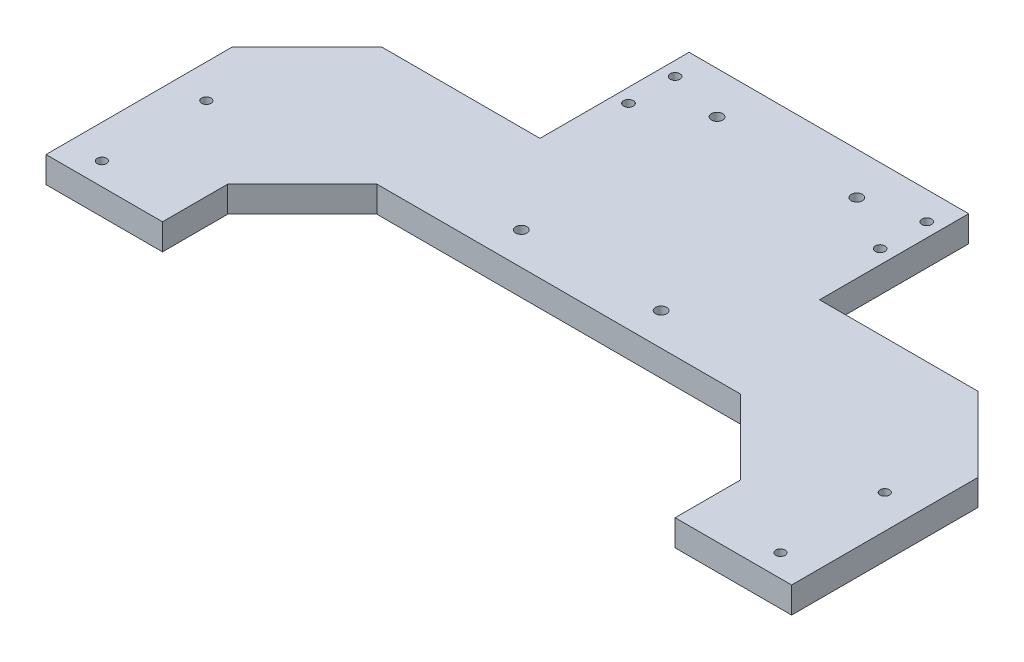
ISO-10303-21;
HEADER;
FILE_DESCRIPTION(('STEP AP214'),'2;1');
FILE_NAME('part.step','',(''),(''),'','','');
FILE_SCHEMA(('AUTOMOTIVE_DESIGN { 1 0 10303 214 1 1 1 1 }'));
ENDSEC;
DATA;
#1=APPLICATION_CONTEXT('core data for automotive mechanical design processes');
#2=APPLICATION_PROTOCOL_DEFINITION('international standard','automotive_design',2000,#1);
#3=PRODUCT_CONTEXT('',#1,'mechanical');
#4=PRODUCT('Part','Part','',(#3));
#5=PRODUCT_RELATED_PRODUCT_CATEGORY('part','',(#4));
#6=PRODUCT_DEFINITION_FORMATION('','',#4);
#7=PRODUCT_DEFINITION_CONTEXT('part definition',#1,'design');
#8=PRODUCT_DEFINITION('design','',#6,#7);
#9=PRODUCT_DEFINITION_SHAPE('','',#8);
#10=(LENGTH_UNIT() NAMED_UNIT(*) SI_UNIT(.MILLI.,.METRE.));
#11=(NAMED_UNIT(*) PLANE_ANGLE_UNIT() SI_UNIT($,.RADIAN.));
#12=(NAMED_UNIT(*) SI_UNIT($,.STERADIAN.) SOLID_ANGLE_UNIT());
#13=UNCERTAINTY_MEASURE_WITH_UNIT(LENGTH_MEASURE(1.E-05),#10,'distance_accuracy_value','');
#14=(GEOMETRIC_REPRESENTATION_CONTEXT(3) GLOBAL_UNCERTAINTY_ASSIGNED_CONTEXT((#13)) GLOBAL_UNIT_ASSIGNED_CONTEXT((#10,
#11,#12)) REPRESENTATION_CONTEXT('',''));
#15=CARTESIAN_POINT('',(0.,0.,0.));
#16=DIRECTION('',(0.,0.,1.));
#17=DIRECTION('',(1.,0.,0.));
#18=AXIS2_PLACEMENT_3D('',#15,#16,#17);
#19=CARTESIAN_POINT('',(-200.,14.,180.));
#20=DIRECTION('',(0.,0.,-1.));
#21=DIRECTION('',(-1.,0.,0.));
#22=AXIS2_PLACEMENT_3D('',#19,#20,#21);
#23=PLANE('',#22);
#24=DIRECTION('',(1.,0.,0.));
#25=VECTOR('',#24,1.);
#26=CARTESIAN_POINT('',(-200.,0.,180.));
#27=LINE('',#26,#25);
#28=CARTESIAN_POINT('',(-200.,0.,180.));
#29=VERTEX_POINT('',#28);
#30=CARTESIAN_POINT('',(-137.5,0.,180.));
#31=VERTEX_POINT('',#30);
#32=EDGE_CURVE('E166',#29,#31,#27,.T.);
#33=ORIENTED_EDGE('',*,*,#32,.T.);
#34=DIRECTION('',(0.,1.,0.));
#35=VECTOR('',#34,1.);
#36=CARTESIAN_POINT('',(-137.5,0.,180.));
#37=LINE('',#36,#35);
#38=CARTESIAN_POINT('',(-137.5,14.,180.));
#39=VERTEX_POINT('',#38);
#40=EDGE_CURVE('E177',#31,#39,#37,.T.);
#41=ORIENTED_EDGE('',*,*,#40,.T.);
#42=DIRECTION('',(1.,0.,0.));
#43=VECTOR('',#42,1.);
#44=CARTESIAN_POINT('',(-200.,14.,180.));
#45=LINE('',#44,#43);
#46=CARTESIAN_POINT('',(-200.,14.,180.));
#47=VERTEX_POINT('',#46);
#48=EDGE_CURVE('E333',#47,#39,#45,.T.);
#49=ORIENTED_EDGE('',*,*,#48,.F.);
#50=DIRECTION('',(0.,-1.,0.));
#51=VECTOR('',#50,1.);
#52=CARTESIAN_POINT('',(-200.,14.,180.));
#53=LINE('',#52,#51);
#54=EDGE_CURVE('E190',#47,#29,#53,.T.);
#55=ORIENTED_EDGE('',*,*,#54,.T.);
#56=EDGE_LOOP('',(#33,#41,#49,#55));
#57=FACE_BOUND('',#56,.T.);
#58=ADVANCED_FACE('F43',(#57),#23,.F.);
#59=CARTESIAN_POINT('',(75.,14.,40.));
#60=DIRECTION('',(-1.,0.,0.));
#61=DIRECTION('',(0.,0.,1.));
#62=AXIS2_PLACEMENT_3D('',#59,#60,#61);
#63=PLANE('',#62);
#64=DIRECTION('',(0.,0.,-1.));
#65=VECTOR('',#64,1.);
#66=CARTESIAN_POINT('',(75.,0.,40.));
#67=LINE('',#66,#65);
#68=CARTESIAN_POINT('',(75.,0.,40.));
#69=VERTEX_POINT('',#68);
#70=CARTESIAN_POINT('',(75.,0.,-40.));
#71=VERTEX_POINT('',#70);
#72=EDGE_CURVE('E347',#69,#71,#67,.T.);
#73=ORIENTED_EDGE('',*,*,#72,.T.);
#74=DIRECTION('',(0.,-1.,0.));
#75=VECTOR('',#74,1.);
#76=CARTESIAN_POINT('',(75.,14.,-40.));
#77=LINE('',#76,#75);
#78=CARTESIAN_POINT('',(75.,14.,-40.));
#79=VERTEX_POINT('',#78);
#80=EDGE_CURVE('E226',#79,#71,#77,.T.);
#81=ORIENTED_EDGE('',*,*,#80,.F.);
#82=DIRECTION('',(0.,0.,-1.));
#83=VECTOR('',#82,1.);
#84=CARTESIAN_POINT('',(75.,14.,40.));
#85=LINE('',#84,#83);
#86=CARTESIAN_POINT('',(75.,14.,40.));
#87=VERTEX_POINT('',#86);
#88=EDGE_CURVE('E206',#87,#79,#85,.T.);
#89=ORIENTED_EDGE('',*,*,#88,.F.);
#90=DIRECTION('',(0.,-1.,0.));
#91=VECTOR('',#90,1.);
#92=CARTESIAN_POINT('',(75.,14.,40.));
#93=LINE('',#92,#91);
#94=EDGE_CURVE('E207',#87,#69,#93,.T.);
#95=ORIENTED_EDGE('',*,*,#94,.T.);
#96=EDGE_LOOP('',(#73,#81,#89,#95));
#97=FACE_BOUND('',#96,.T.);
#98=ADVANCED_FACE('F302',(#97),#63,.F.);
#99=CARTESIAN_POINT('',(-75.,14.,-40.));
#100=DIRECTION('',(0.,0.,1.));
#101=DIRECTION('',(1.,0.,0.));
#102=AXIS2_PLACEMENT_3D('',#99,#100,#101);
#103=PLANE('',#102);
#104=DIRECTION('',(-1.,0.,0.));
#105=VECTOR('',#104,1.);
#106=CARTESIAN_POINT('',(-75.,0.,-40.));
#107=LINE('',#106,#105);
#108=CARTESIAN_POINT('',(-75.,0.,-40.));
#109=VERTEX_POINT('',#108);
#110=EDGE_CURVE('E351',#71,#109,#107,.T.);
#111=ORIENTED_EDGE('',*,*,#110,.T.);
#112=DIRECTION('',(0.,-1.,0.));
#113=VECTOR('',#112,1.);
#114=CARTESIAN_POINT('',(-75.,14.,-40.));
#115=LINE('',#114,#113);
#116=CARTESIAN_POINT('',(-75.,14.,-40.));
#117=VERTEX_POINT('',#116);
#118=EDGE_CURVE('E222',#117,#109,#115,.T.);
#119=ORIENTED_EDGE('',*,*,#118,.F.);
#120=DIRECTION('',(-1.,0.,0.));
#121=VECTOR('',#120,1.);
#122=CARTESIAN_POINT('',(-75.,14.,-40.));
#123=LINE('',#122,#121);
#124=EDGE_CURVE('E627',#79,#117,#123,.T.);
#125=ORIENTED_EDGE('',*,*,#124,.F.);
#126=ORIENTED_EDGE('',*,*,#80,.T.);
#127=EDGE_LOOP('',(#111,#119,#125,#126));
#128=FACE_BOUND('',#127,.T.);
#129=ADVANCED_FACE('F308',(#128),#103,.F.);
#130=CARTESIAN_POINT('',(-75.,14.,40.));
#131=DIRECTION('',(1.,0.,0.));
#132=DIRECTION('',(0.,0.,-1.));
#133=AXIS2_PLACEMENT_3D('',#130,#131,#132);
#134=PLANE('',#133);
#135=DIRECTION('',(0.,0.,1.));
#136=VECTOR('',#135,1.);
#137=CARTESIAN_POINT('',(-75.,0.,40.));
#138=LINE('',#137,#136);
#139=CARTESIAN_POINT('',(-75.,0.,40.));
#140=VERTEX_POINT('',#139);
#141=EDGE_CURVE('E355',#109,#140,#138,.T.);
#142=ORIENTED_EDGE('',*,*,#141,.T.);
#143=DIRECTION('',(0.,-1.,0.));
#144=VECTOR('',#143,1.);
#145=CARTESIAN_POINT('',(-75.,14.,40.));
#146=LINE('',#145,#144);
#147=CARTESIAN_POINT('',(-75.,14.,40.));
#148=VERTEX_POINT('',#147);
#149=EDGE_CURVE('E218',#148,#140,#146,.T.);
#150=ORIENTED_EDGE('',*,*,#149,.F.);
#151=DIRECTION('',(0.,0.,1.));
#152=VECTOR('',#151,1.);
#153=CARTESIAN_POINT('',(-75.,14.,40.));
#154=LINE('',#153,#152);
#155=EDGE_CURVE('E625',#117,#148,#154,.T.);
#156=ORIENTED_EDGE('',*,*,#155,.F.);
#157=ORIENTED_EDGE('',*,*,#118,.T.);
#158=EDGE_LOOP('',(#142,#150,#156,#157));
#159=FACE_BOUND('',#158,.T.);
#160=ADVANCED_FACE('F464',(#159),#134,.F.);
#161=CARTESIAN_POINT('',(-200.,14.,40.));
#162=DIRECTION('',(0.,0.,1.));
#163=DIRECTION('',(1.,0.,0.));
#164=AXIS2_PLACEMENT_3D('',#161,#162,#163);
#165=PLANE('',#164);
#166=DIRECTION('',(-1.,0.,0.));
#167=VECTOR('',#166,1.);
#168=CARTESIAN_POINT('',(-200.,0.,40.));
#169=LINE('',#168,#167);
#170=CARTESIAN_POINT('',(-160.,0.,40.));
#171=VERTEX_POINT('',#170);
#172=EDGE_CURVE('E357',#140,#171,#169,.T.);
#173=ORIENTED_EDGE('',*,*,#172,.T.);
#174=DIRECTION('',(0.,1.,0.));
#175=VECTOR('',#174,1.);
#176=CARTESIAN_POINT('',(-160.,14.,40.));
#177=LINE('',#176,#175);
#178=CARTESIAN_POINT('',(-160.,14.,40.));
#179=VERTEX_POINT('',#178);
#180=EDGE_CURVE('E68',#171,#179,#177,.T.);
#181=ORIENTED_EDGE('',*,*,#180,.T.);
#182=DIRECTION('',(-1.,0.,0.));
#183=VECTOR('',#182,1.);
#184=CARTESIAN_POINT('',(-200.,14.,40.));
#185=LINE('',#184,#183);
#186=EDGE_CURVE('E339',#148,#179,#185,.T.);
#187=ORIENTED_EDGE('',*,*,#186,.F.);
#188=ORIENTED_EDGE('',*,*,#149,.T.);
#189=EDGE_LOOP('',(#173,#181,#187,#188));
#190=FACE_BOUND('',#189,.T.);
#191=ADVANCED_FACE('F323',(#190),#165,.F.);
#192=CARTESIAN_POINT('',(-200.,14.,180.));
#193=DIRECTION('',(1.,0.,0.));
#194=DIRECTION('',(0.,0.,-1.));
#195=AXIS2_PLACEMENT_3D('',#192,#193,#194);
#196=PLANE('',#195);
#197=DIRECTION('',(0.,0.,1.));
#198=VECTOR('',#197,1.);
#199=CARTESIAN_POINT('',(-200.,14.,180.));
#200=LINE('',#199,#198);
#201=CARTESIAN_POINT('',(-200.,14.,80.));
#202=VERTEX_POINT('',#201);
#203=EDGE_CURVE('E334',#202,#47,#200,.T.);
#204=ORIENTED_EDGE('',*,*,#203,.F.);
#205=DIRECTION('',(0.,-1.,0.));
#206=VECTOR('',#205,1.);
#207=CARTESIAN_POINT('',(-200.,14.,80.));
#208=LINE('',#207,#206);
#209=CARTESIAN_POINT('',(-200.,0.,80.));
#210=VERTEX_POINT('',#209);
#211=EDGE_CURVE('E261',#202,#210,#208,.T.);
#212=ORIENTED_EDGE('',*,*,#211,.T.);
#213=DIRECTION('',(0.,0.,1.));
#214=VECTOR('',#213,1.);
#215=CARTESIAN_POINT('',(-200.,0.,180.));
#216=LINE('',#215,#214);
#217=EDGE_CURVE('E200',#210,#29,#216,.T.);
#218=ORIENTED_EDGE('',*,*,#217,.T.);
#219=ORIENTED_EDGE('',*,*,#54,.F.);
#220=EDGE_LOOP('',(#204,#212,#218,#219));
#221=FACE_BOUND('',#220,.T.);
#222=ADVANCED_FACE('F315',(#221),#196,.F.);
#223=CARTESIAN_POINT('',(137.5,14.,180.));
#224=VERTEX_POINT('',#223);
#225=CARTESIAN_POINT('',(200.,14.,180.));
#226=VERTEX_POINT('',#225);
#227=EDGE_CURVE('E328',#224,#226,#45,.T.);
#228=ORIENTED_EDGE('',*,*,#227,.F.);
#229=DIRECTION('',(0.,1.,0.));
#230=VECTOR('',#229,1.);
#231=CARTESIAN_POINT('',(137.5,0.,180.));
#232=LINE('',#231,#230);
#233=CARTESIAN_POINT('',(137.5,0.,180.));
#234=VERTEX_POINT('',#233);
#235=EDGE_CURVE('E185',#234,#224,#232,.T.);
#236=ORIENTED_EDGE('',*,*,#235,.F.);
#237=CARTESIAN_POINT('',(200.,0.,180.));
#238=VERTEX_POINT('',#237);
#239=EDGE_CURVE('E193',#234,#238,#27,.T.);
#240=ORIENTED_EDGE('',*,*,#239,.T.);
#241=DIRECTION('',(0.,-1.,0.));
#242=VECTOR('',#241,1.);
#243=CARTESIAN_POINT('',(200.,14.,180.));
#244=LINE('',#243,#242);
#245=EDGE_CURVE('E211',#226,#238,#244,.T.);
#246=ORIENTED_EDGE('',*,*,#245,.F.);
#247=EDGE_LOOP('',(#228,#236,#240,#246));
#248=FACE_BOUND('',#247,.T.);
#249=ADVANCED_FACE('F304',(#248),#23,.F.);
#250=CARTESIAN_POINT('',(200.,14.,180.));
#251=DIRECTION('',(-1.,0.,0.));
#252=DIRECTION('',(0.,0.,1.));
#253=AXIS2_PLACEMENT_3D('',#250,#251,#252);
#254=PLANE('',#253);
#255=DIRECTION('',(0.,0.,-1.));
#256=VECTOR('',#255,1.);
#257=CARTESIAN_POINT('',(200.,0.,180.));
#258=LINE('',#257,#256);
#259=CARTESIAN_POINT('',(200.,0.,80.0000000000001));
#260=VERTEX_POINT('',#259);
#261=EDGE_CURVE('E192',#238,#260,#258,.T.);
#262=ORIENTED_EDGE('',*,*,#261,.T.);
#263=DIRECTION('',(0.,1.,0.));
#264=VECTOR('',#263,1.);
#265=CARTESIAN_POINT('',(200.,14.,80.0000000000001));
#266=LINE('',#265,#264);
#267=CARTESIAN_POINT('',(200.,14.,80.0000000000001));
#268=VERTEX_POINT('',#267);
#269=EDGE_CURVE('E253',#260,#268,#266,.T.);
#270=ORIENTED_EDGE('',*,*,#269,.T.);
#271=DIRECTION('',(0.,0.,-1.));
#272=VECTOR('',#271,1.);
#273=CARTESIAN_POINT('',(200.,14.,180.));
#274=LINE('',#273,#272);
#275=EDGE_CURVE('E338',#226,#268,#274,.T.);
#276=ORIENTED_EDGE('',*,*,#275,.F.);
#277=ORIENTED_EDGE('',*,*,#245,.T.);
#278=EDGE_LOOP('',(#262,#270,#276,#277));
#279=FACE_BOUND('',#278,.T.);
#280=ADVANCED_FACE('F314',(#279),#254,.F.);
#281=CARTESIAN_POINT('',(75.,14.,40.));
#282=DIRECTION('',(0.,0.,1.));
#283=DIRECTION('',(1.,0.,0.));
#284=AXIS2_PLACEMENT_3D('',#281,#282,#283);
#285=PLANE('',#284);
#286=DIRECTION('',(-1.,0.,0.));
#287=VECTOR('',#286,1.);
#288=CARTESIAN_POINT('',(75.,14.,40.));
#289=LINE('',#288,#287);
#290=CARTESIAN_POINT('',(160.,14.,40.));
#291=VERTEX_POINT('',#290);
#292=EDGE_CURVE('E212',#291,#87,#289,.T.);
#293=ORIENTED_EDGE('',*,*,#292,.F.);
#294=DIRECTION('',(0.,-1.,0.));
#295=VECTOR('',#294,1.);
#296=CARTESIAN_POINT('',(160.,14.,40.));
#297=LINE('',#296,#295);
#298=CARTESIAN_POINT('',(160.,0.,40.));
#299=VERTEX_POINT('',#298);
#300=EDGE_CURVE('E243',#291,#299,#297,.T.);
#301=ORIENTED_EDGE('',*,*,#300,.T.);
#302=DIRECTION('',(-1.,0.,0.));
#303=VECTOR('',#302,1.);
#304=CARTESIAN_POINT('',(75.,0.,40.));
#305=LINE('',#304,#303);
#306=EDGE_CURVE('E198',#299,#69,#305,.T.);
#307=ORIENTED_EDGE('',*,*,#306,.T.);
#308=ORIENTED_EDGE('',*,*,#94,.F.);
#309=EDGE_LOOP('',(#293,#301,#307,#308));
#310=FACE_BOUND('',#309,.T.);
#311=ADVANCED_FACE('F321',(#310),#285,.F.);
#312=CARTESIAN_POINT('',(0.,14.,0.));
#313=DIRECTION('',(0.,-1.,0.));
#314=DIRECTION('',(0.,0.,-1.));
#315=AXIS2_PLACEMENT_3D('',#312,#313,#314);
#316=PLANE('',#315);
#317=CARTESIAN_POINT('',(-37.5,14.,87.5));
#318=DIRECTION('',(0.,-1.,0.));
#319=DIRECTION('',(0.,0.,-1.));
#320=AXIS2_PLACEMENT_3D('',#317,#318,#319);
#321=CIRCLE('',#320,3.);
#322=CARTESIAN_POINT('',(-37.5,14.,84.5));
#323=VERTEX_POINT('',#322);
#324=EDGE_CURVE('E352',#323,#323,#321,.T.);
#325=ORIENTED_EDGE('',*,*,#324,.T.);
#326=EDGE_LOOP('',(#325));
#327=FACE_BOUND('',#326,.T.);
#328=CARTESIAN_POINT('',(37.5,14.,87.4999999999999));
#329=DIRECTION('',(0.,-1.,0.));
#330=DIRECTION('',(0.,0.,-1.));
#331=AXIS2_PLACEMENT_3D('',#328,#329,#330);
#332=CIRCLE('',#331,3.);
#333=CARTESIAN_POINT('',(37.5,14.,84.4999999999999));
#334=VERTEX_POINT('',#333);
#335=EDGE_CURVE('E643',#334,#334,#332,.T.);
#336=ORIENTED_EDGE('',*,*,#335,.T.);
#337=EDGE_LOOP('',(#336));
#338=FACE_BOUND('',#337,.T.);
#339=CARTESIAN_POINT('',(37.5,14.,-17.5));
#340=DIRECTION('',(0.,-1.,0.));
#341=DIRECTION('',(0.,0.,-1.));
#342=AXIS2_PLACEMENT_3D('',#339,#340,#341);
#343=CIRCLE('',#342,3.);
#344=CARTESIAN_POINT('',(37.5,14.,-20.5));
#345=VERTEX_POINT('',#344);
#346=EDGE_CURVE('E647',#345,#345,#343,.T.);
#347=ORIENTED_EDGE('',*,*,#346,.T.);
#348=EDGE_LOOP('',(#347));
#349=FACE_BOUND('',#348,.T.);
#350=CARTESIAN_POINT('',(-67.5,14.,0.));
#351=DIRECTION('',(0.,-1.,0.));
#352=DIRECTION('',(0.,0.,-1.));
#353=AXIS2_PLACEMENT_3D('',#350,#351,#352);
#354=CIRCLE('',#353,2.6);
#355=CARTESIAN_POINT('',(-67.5,14.,-2.60000000000001));
#356=VERTEX_POINT('',#355);
#357=EDGE_CURVE('E651',#356,#356,#354,.T.);
#358=ORIENTED_EDGE('',*,*,#357,.T.);
#359=EDGE_LOOP('',(#358));
#360=FACE_BOUND('',#359,.T.);
#361=CARTESIAN_POINT('',(-182.,14.,168.));
#362=DIRECTION('',(0.,-1.,0.));
#363=DIRECTION('',(0.,0.,-1.));
#364=AXIS2_PLACEMENT_3D('',#361,#362,#363);
#365=CIRCLE('',#364,2.5);
#366=CARTESIAN_POINT('',(-182.,14.,165.5));
#367=VERTEX_POINT('',#366);
#368=EDGE_CURVE('E655',#367,#367,#365,.T.);
#369=ORIENTED_EDGE('',*,*,#368,.T.);
#370=EDGE_LOOP('',(#369));
#371=FACE_BOUND('',#370,.T.);
#372=CARTESIAN_POINT('',(-182.,14.,112.));
#373=DIRECTION('',(0.,-1.,0.));
#374=DIRECTION('',(0.,0.,-1.));
#375=AXIS2_PLACEMENT_3D('',#372,#373,#374);
#376=CIRCLE('',#375,2.5);
#377=CARTESIAN_POINT('',(-182.,14.,109.5));
#378=VERTEX_POINT('',#377);
#379=EDGE_CURVE('E659',#378,#378,#376,.T.);
#380=ORIENTED_EDGE('',*,*,#379,.T.);
#381=EDGE_LOOP('',(#380));
#382=FACE_BOUND('',#381,.T.);
#383=CARTESIAN_POINT('',(-37.5,14.,-17.5));
#384=DIRECTION('',(0.,-1.,0.));
#385=DIRECTION('',(0.,0.,-1.));
#386=AXIS2_PLACEMENT_3D('',#383,#384,#385);
#387=CIRCLE('',#386,3.);
#388=CARTESIAN_POINT('',(-37.5,14.,-20.5));
#389=VERTEX_POINT('',#388);
#390=EDGE_CURVE('E663',#389,#389,#387,.T.);
#391=ORIENTED_EDGE('',*,*,#390,.T.);
#392=EDGE_LOOP('',(#391));
#393=FACE_BOUND('',#392,.T.);
#394=CARTESIAN_POINT('',(182.,14.,112.));
#395=DIRECTION('',(0.,-1.,0.));
#396=DIRECTION('',(0.,0.,-1.));
#397=AXIS2_PLACEMENT_3D('',#394,#395,#396);
#398=CIRCLE('',#397,2.50000000000005);
#399=CARTESIAN_POINT('',(182.,14.,109.5));
#400=VERTEX_POINT('',#399);
#401=EDGE_CURVE('E667',#400,#400,#398,.T.);
#402=ORIENTED_EDGE('',*,*,#401,.T.);
#403=EDGE_LOOP('',(#402));
#404=FACE_BOUND('',#403,.T.);
#405=CARTESIAN_POINT('',(182.,14.,168.));
#406=DIRECTION('',(0.,-1.,0.));
#407=DIRECTION('',(0.,0.,-1.));
#408=AXIS2_PLACEMENT_3D('',#405,#406,#407);
#409=CIRCLE('',#408,2.50000000000006);
#410=CARTESIAN_POINT('',(182.,14.,165.5));
#411=VERTEX_POINT('',#410);
#412=EDGE_CURVE('E671',#411,#411,#409,.T.);
#413=ORIENTED_EDGE('',*,*,#412,.T.);
#414=EDGE_LOOP('',(#413));
#415=FACE_BOUND('',#414,.T.);
#416=CARTESIAN_POINT('',(67.5,14.,0.));
#417=DIRECTION('',(0.,-1.,0.));
#418=DIRECTION('',(0.,0.,-1.));
#419=AXIS2_PLACEMENT_3D('',#416,#417,#418);
#420=CIRCLE('',#419,2.6);
#421=CARTESIAN_POINT('',(67.5,14.,-2.60000000000005));
#422=VERTEX_POINT('',#421);
#423=EDGE_CURVE('E675',#422,#422,#420,.T.);
#424=ORIENTED_EDGE('',*,*,#423,.T.);
#425=EDGE_LOOP('',(#424));
#426=FACE_BOUND('',#425,.T.);
#427=CARTESIAN_POINT('',(67.5,14.,-25.));
#428=DIRECTION('',(0.,-1.,0.));
#429=DIRECTION('',(0.,0.,-1.));
#430=AXIS2_PLACEMENT_3D('',#427,#428,#429);
#431=CIRCLE('',#430,2.6);
#432=CARTESIAN_POINT('',(67.5,14.,-27.6));
#433=VERTEX_POINT('',#432);
#434=EDGE_CURVE('E679',#433,#433,#431,.T.);
#435=ORIENTED_EDGE('',*,*,#434,.T.);
#436=EDGE_LOOP('',(#435));
#437=FACE_BOUND('',#436,.T.);
#438=CARTESIAN_POINT('',(-67.5,14.,-25.));
#439=DIRECTION('',(0.,-1.,0.));
#440=DIRECTION('',(0.,0.,-1.));
#441=AXIS2_PLACEMENT_3D('',#438,#439,#440);
#442=CIRCLE('',#441,2.6);
#443=CARTESIAN_POINT('',(-67.5,14.,-27.6));
#444=VERTEX_POINT('',#443);
#445=EDGE_CURVE('E683',#444,#444,#442,.T.);
#446=ORIENTED_EDGE('',*,*,#445,.T.);
#447=EDGE_LOOP('',(#446));
#448=FACE_BOUND('',#447,.T.);
#449=ORIENTED_EDGE('',*,*,#275,.T.);
#450=DIRECTION('',(0.707106781186547,0.,0.707106781186548));
#451=VECTOR('',#450,1.);
#452=CARTESIAN_POINT('',(160.,14.,40.));
#453=LINE('',#452,#451);
#454=EDGE_CURVE('E258',#268,#291,#453,.F.);
#455=ORIENTED_EDGE('',*,*,#454,.T.);
#456=ORIENTED_EDGE('',*,*,#292,.T.);
#457=ORIENTED_EDGE('',*,*,#88,.T.);
#458=ORIENTED_EDGE('',*,*,#124,.T.);
#459=ORIENTED_EDGE('',*,*,#155,.T.);
#460=ORIENTED_EDGE('',*,*,#186,.T.);
#461=DIRECTION('',(0.707106781186549,0.,-0.707106781186547));
#462=VECTOR('',#461,1.);
#463=CARTESIAN_POINT('',(-200.,14.,80.));
#464=LINE('',#463,#462);
#465=EDGE_CURVE('E60',#179,#202,#464,.F.);
#466=ORIENTED_EDGE('',*,*,#465,.T.);
#467=ORIENTED_EDGE('',*,*,#203,.T.);
#468=ORIENTED_EDGE('',*,*,#48,.T.);
#469=DIRECTION('',(0.,0.,-1.));
#470=VECTOR('',#469,1.);
#471=CARTESIAN_POINT('',(-137.5,14.,0.));
#472=LINE('',#471,#470);
#473=CARTESIAN_POINT('',(-137.5,14.,145.));
#474=VERTEX_POINT('',#473);
#475=EDGE_CURVE('E180',#39,#474,#472,.T.);
#476=ORIENTED_EDGE('',*,*,#475,.T.);
#477=DIRECTION('',(-0.707106781186544,0.,0.707106781186551));
#478=VECTOR('',#477,1.);
#479=CARTESIAN_POINT('',(3.74999999999955,14.,3.74999999999952));
#480=LINE('',#479,#478);
#481=CARTESIAN_POINT('',(-97.5,14.,105.));
#482=VERTEX_POINT('',#481);
#483=EDGE_CURVE('E53',#474,#482,#480,.F.);
#484=ORIENTED_EDGE('',*,*,#483,.T.);
#485=DIRECTION('',(1.,0.,0.));
#486=VECTOR('',#485,1.);
#487=CARTESIAN_POINT('',(0.,14.,105.));
#488=LINE('',#487,#486);
#489=CARTESIAN_POINT('',(97.4999999999997,14.,105.));
#490=VERTEX_POINT('',#489);
#491=EDGE_CURVE('E277',#482,#490,#488,.T.);
#492=ORIENTED_EDGE('',*,*,#491,.T.);
#493=DIRECTION('',(-0.707106781186551,0.,-0.707106781186544));
#494=VECTOR('',#493,1.);
#495=CARTESIAN_POINT('',(-3.75000000000068,14.,3.75000000000072));
#496=LINE('',#495,#494);
#497=CARTESIAN_POINT('',(137.5,14.,145.));
#498=VERTEX_POINT('',#497);
#499=EDGE_CURVE('E267',#490,#498,#496,.F.);
#500=ORIENTED_EDGE('',*,*,#499,.T.);
#501=DIRECTION('',(0.,0.,1.));
#502=VECTOR('',#501,1.);
#503=CARTESIAN_POINT('',(137.5,14.,0.));
#504=LINE('',#503,#502);
#505=EDGE_CURVE('E285',#498,#224,#504,.T.);
#506=ORIENTED_EDGE('',*,*,#505,.T.);
#507=ORIENTED_EDGE('',*,*,#227,.T.);
#508=EDGE_LOOP('',(#449,#455,#456,#457,#458,#459,#460,#466,#467,#468,#476,#484,#492,#500,#506,#507));
#509=FACE_BOUND('',#508,.T.);
#510=ADVANCED_FACE('F276',(#327,#338,#349,#360,#371,#382,#393,#404,#415,#426,#437,#448,#509),
#316,.F.);
#511=CARTESIAN_POINT('',(0.,0.,0.));
#512=DIRECTION('',(0.,-1.,0.));
#513=DIRECTION('',(0.,0.,-1.));
#514=AXIS2_PLACEMENT_3D('',#511,#512,#513);
#515=PLANE('',#514);
#516=CARTESIAN_POINT('',(-37.5,0.,87.5));
#517=DIRECTION('',(0.,1.,0.));
#518=DIRECTION('',(0.,0.,1.));
#519=AXIS2_PLACEMENT_3D('',#516,#517,#518);
#520=CIRCLE('',#519,3.);
#521=CARTESIAN_POINT('',(-37.5,0.,90.5));
#522=VERTEX_POINT('',#521);
#523=EDGE_CURVE('E704',#522,#522,#520,.T.);
#524=ORIENTED_EDGE('',*,*,#523,.T.);
#525=EDGE_LOOP('',(#524));
#526=FACE_BOUND('',#525,.T.);
#527=ORIENTED_EDGE('',*,*,#306,.F.);
#528=DIRECTION('',(-0.707106781186547,0.,-0.707106781186548));
#529=VECTOR('',#528,1.);
#530=CARTESIAN_POINT('',(60.0000000000002,0.,-60.));
#531=LINE('',#530,#529);
#532=EDGE_CURVE('E250',#299,#260,#531,.F.);
#533=ORIENTED_EDGE('',*,*,#532,.T.);
#534=ORIENTED_EDGE('',*,*,#261,.F.);
#535=ORIENTED_EDGE('',*,*,#239,.F.);
#536=DIRECTION('',(0.,0.,-1.));
#537=VECTOR('',#536,1.);
#538=CARTESIAN_POINT('',(137.5,0.,105.));
#539=LINE('',#538,#537);
#540=CARTESIAN_POINT('',(137.5,0.,145.));
#541=VERTEX_POINT('',#540);
#542=EDGE_CURVE('E173',#234,#541,#539,.T.);
#543=ORIENTED_EDGE('',*,*,#542,.T.);
#544=DIRECTION('',(0.707106781186551,0.,0.707106781186544));
#545=VECTOR('',#544,1.);
#546=CARTESIAN_POINT('',(97.4999999999997,0.,105.));
#547=LINE('',#546,#545);
#548=CARTESIAN_POINT('',(97.4999999999997,0.,105.));
#549=VERTEX_POINT('',#548);
#550=EDGE_CURVE('E270',#541,#549,#547,.F.);
#551=ORIENTED_EDGE('',*,*,#550,.T.);
#552=DIRECTION('',(-1.,0.,0.));
#553=VECTOR('',#552,1.);
#554=CARTESIAN_POINT('',(137.5,0.,105.));
#555=LINE('',#554,#553);
#556=CARTESIAN_POINT('',(-97.5,0.,105.));
#557=VERTEX_POINT('',#556);
#558=EDGE_CURVE('E186',#549,#557,#555,.T.);
#559=ORIENTED_EDGE('',*,*,#558,.T.);
#560=DIRECTION('',(0.707106781186544,0.,-0.707106781186551));
#561=VECTOR('',#560,1.);
#562=CARTESIAN_POINT('',(-137.5,0.,145.));
#563=LINE('',#562,#561);
#564=CARTESIAN_POINT('',(-137.5,0.,145.));
#565=VERTEX_POINT('',#564);
#566=EDGE_CURVE('E11',#557,#565,#563,.F.);
#567=ORIENTED_EDGE('',*,*,#566,.T.);
#568=DIRECTION('',(0.,0.,1.));
#569=VECTOR('',#568,1.);
#570=CARTESIAN_POINT('',(-137.5,0.,105.));
#571=LINE('',#570,#569);
#572=EDGE_CURVE('E159',#565,#31,#571,.T.);
#573=ORIENTED_EDGE('',*,*,#572,.T.);
#574=ORIENTED_EDGE('',*,*,#32,.F.);
#575=ORIENTED_EDGE('',*,*,#217,.F.);
#576=DIRECTION('',(-0.707106781186549,0.,0.707106781186547));
#577=VECTOR('',#576,1.);
#578=CARTESIAN_POINT('',(-59.9999999999997,0.,-59.9999999999999));
#579=LINE('',#578,#577);
#580=EDGE_CURVE('E247',#210,#171,#579,.F.);
#581=ORIENTED_EDGE('',*,*,#580,.T.);
#582=ORIENTED_EDGE('',*,*,#172,.F.);
#583=ORIENTED_EDGE('',*,*,#141,.F.);
#584=ORIENTED_EDGE('',*,*,#110,.F.);
#585=ORIENTED_EDGE('',*,*,#72,.F.);
#586=EDGE_LOOP('',(#527,#533,#534,#535,#543,#551,#559,#567,#573,#574,#575,#581,#582,#583,#584,#585));
#587=FACE_BOUND('',#586,.T.);
#588=CARTESIAN_POINT('',(37.5,0.,87.4999999999999));
#589=DIRECTION('',(0.,1.,0.));
#590=DIRECTION('',(0.,0.,-1.));
#591=AXIS2_PLACEMENT_3D('',#588,#589,#590);
#592=CIRCLE('',#591,3.);
#593=CARTESIAN_POINT('',(37.5,0.,84.4999999999999));
#594=VERTEX_POINT('',#593);
#595=EDGE_CURVE('E174',#594,#594,#592,.T.);
#596=ORIENTED_EDGE('',*,*,#595,.T.);
#597=EDGE_LOOP('',(#596));
#598=FACE_BOUND('',#597,.T.);
#599=CARTESIAN_POINT('',(37.5,0.,-17.5));
#600=DIRECTION('',(0.,1.,0.));
#601=DIRECTION('',(0.,0.,-1.));
#602=AXIS2_PLACEMENT_3D('',#599,#600,#601);
#603=CIRCLE('',#602,3.);
#604=CARTESIAN_POINT('',(37.5,0.,-20.5));
#605=VERTEX_POINT('',#604);
#606=EDGE_CURVE('E718',#605,#605,#603,.T.);
#607=ORIENTED_EDGE('',*,*,#606,.T.);
#608=EDGE_LOOP('',(#607));
#609=FACE_BOUND('',#608,.T.);
#610=CARTESIAN_POINT('',(-67.5,0.,0.));
#611=DIRECTION('',(0.,1.,0.));
#612=DIRECTION('',(0.,0.,1.));
#613=AXIS2_PLACEMENT_3D('',#610,#611,#612);
#614=CIRCLE('',#613,2.6);
#615=CARTESIAN_POINT('',(-67.5,0.,2.6));
#616=VERTEX_POINT('',#615);
#617=EDGE_CURVE('E691',#616,#616,#614,.T.);
#618=ORIENTED_EDGE('',*,*,#617,.T.);
#619=EDGE_LOOP('',(#618));
#620=FACE_BOUND('',#619,.T.);
#621=CARTESIAN_POINT('',(-182.,0.,168.));
#622=DIRECTION('',(0.,1.,0.));
#623=DIRECTION('',(0.,0.,1.));
#624=AXIS2_PLACEMENT_3D('',#621,#622,#623);
#625=CIRCLE('',#624,2.5);
#626=CARTESIAN_POINT('',(-182.,0.,170.5));
#627=VERTEX_POINT('',#626);
#628=EDGE_CURVE('E692',#627,#627,#625,.T.);
#629=ORIENTED_EDGE('',*,*,#628,.T.);
#630=EDGE_LOOP('',(#629));
#631=FACE_BOUND('',#630,.T.);
#632=CARTESIAN_POINT('',(-182.,0.,112.));
#633=DIRECTION('',(0.,1.,0.));
#634=DIRECTION('',(0.,0.,1.));
#635=AXIS2_PLACEMENT_3D('',#632,#633,#634);
#636=CIRCLE('',#635,2.5);
#637=CARTESIAN_POINT('',(-182.,0.,114.5));
#638=VERTEX_POINT('',#637);
#639=EDGE_CURVE('E696',#638,#638,#636,.T.);
#640=ORIENTED_EDGE('',*,*,#639,.T.);
#641=EDGE_LOOP('',(#640));
#642=FACE_BOUND('',#641,.T.);
#643=CARTESIAN_POINT('',(-37.5,0.,-17.5));
#644=DIRECTION('',(0.,1.,0.));
#645=DIRECTION('',(0.,0.,1.));
#646=AXIS2_PLACEMENT_3D('',#643,#644,#645);
#647=CIRCLE('',#646,3.);
#648=CARTESIAN_POINT('',(-37.5,0.,-14.5));
#649=VERTEX_POINT('',#648);
#650=EDGE_CURVE('E700',#649,#649,#647,.T.);
#651=ORIENTED_EDGE('',*,*,#650,.T.);
#652=EDGE_LOOP('',(#651));
#653=FACE_BOUND('',#652,.T.);
#654=CARTESIAN_POINT('',(182.,0.,112.));
#655=DIRECTION('',(0.,1.,0.));
#656=DIRECTION('',(0.,0.,-1.));
#657=AXIS2_PLACEMENT_3D('',#654,#655,#656);
#658=CIRCLE('',#657,2.50000000000005);
#659=CARTESIAN_POINT('',(182.,0.,109.5));
#660=VERTEX_POINT('',#659);
#661=EDGE_CURVE('E722',#660,#660,#658,.T.);
#662=ORIENTED_EDGE('',*,*,#661,.T.);
#663=EDGE_LOOP('',(#662));
#664=FACE_BOUND('',#663,.T.);
#665=CARTESIAN_POINT('',(182.,0.,168.));
#666=DIRECTION('',(0.,1.,0.));
#667=DIRECTION('',(0.,0.,-1.));
#668=AXIS2_PLACEMENT_3D('',#665,#666,#667);
#669=CIRCLE('',#668,2.50000000000006);
#670=CARTESIAN_POINT('',(182.,0.,165.5));
#671=VERTEX_POINT('',#670);
#672=EDGE_CURVE('E734',#671,#671,#669,.T.);
#673=ORIENTED_EDGE('',*,*,#672,.T.);
#674=EDGE_LOOP('',(#673));
#675=FACE_BOUND('',#674,.T.);
#676=CARTESIAN_POINT('',(67.5,0.,0.));
#677=DIRECTION('',(0.,1.,0.));
#678=DIRECTION('',(0.,0.,-1.));
#679=AXIS2_PLACEMENT_3D('',#676,#677,#678);
#680=CIRCLE('',#679,2.6);
#681=CARTESIAN_POINT('',(67.5,0.,-2.60000000000005));
#682=VERTEX_POINT('',#681);
#683=EDGE_CURVE('E730',#682,#682,#680,.T.);
#684=ORIENTED_EDGE('',*,*,#683,.T.);
#685=EDGE_LOOP('',(#684));
#686=FACE_BOUND('',#685,.T.);
#687=CARTESIAN_POINT('',(67.5,0.,-25.));
#688=DIRECTION('',(0.,1.,0.));
#689=DIRECTION('',(0.,0.,-1.));
#690=AXIS2_PLACEMENT_3D('',#687,#688,#689);
#691=CIRCLE('',#690,2.6);
#692=CARTESIAN_POINT('',(67.5,0.,-27.6));
#693=VERTEX_POINT('',#692);
#694=EDGE_CURVE('E726',#693,#693,#691,.T.);
#695=ORIENTED_EDGE('',*,*,#694,.T.);
#696=EDGE_LOOP('',(#695));
#697=FACE_BOUND('',#696,.T.);
#698=CARTESIAN_POINT('',(-67.5,0.,-25.));
#699=DIRECTION('',(0.,1.,0.));
#700=DIRECTION('',(0.,0.,1.));
#701=AXIS2_PLACEMENT_3D('',#698,#699,#700);
#702=CIRCLE('',#701,2.6);
#703=CARTESIAN_POINT('',(-67.5,0.,-22.4));
#704=VERTEX_POINT('',#703);
#705=EDGE_CURVE('E687',#704,#704,#702,.T.);
#706=ORIENTED_EDGE('',*,*,#705,.T.);
#707=EDGE_LOOP('',(#706));
#708=FACE_BOUND('',#707,.T.);
#709=ADVANCED_FACE('F162',(#526,#587,#598,#609,#620,#631,#642,#653,#664,#675,#686,#697,#708),
#515,.T.);
#710=CARTESIAN_POINT('',(-67.5,0.,-25.));
#711=DIRECTION('',(0.,1.,0.));
#712=DIRECTION('',(0.,0.,1.));
#713=AXIS2_PLACEMENT_3D('',#710,#711,#712);
#714=CYLINDRICAL_SURFACE('',#713,2.6);
#715=ORIENTED_EDGE('',*,*,#705,.F.);
#716=EDGE_LOOP('',(#715));
#717=FACE_BOUND('',#716,.T.);
#718=ORIENTED_EDGE('',*,*,#445,.F.);
#719=EDGE_LOOP('',(#718));
#720=FACE_BOUND('',#719,.T.);
#721=ADVANCED_FACE('F421',(#717,#720),#714,.F.);
#722=CARTESIAN_POINT('',(67.5,0.,-25.));
#723=DIRECTION('',(0.,1.,0.));
#724=DIRECTION('',(0.,0.,1.));
#725=AXIS2_PLACEMENT_3D('',#722,#723,#724);
#726=CYLINDRICAL_SURFACE('',#725,2.6);
#727=ORIENTED_EDGE('',*,*,#694,.F.);
#728=EDGE_LOOP('',(#727));
#729=FACE_BOUND('',#728,.T.);
#730=ORIENTED_EDGE('',*,*,#434,.F.);
#731=EDGE_LOOP('',(#730));
#732=FACE_BOUND('',#731,.T.);
#733=ADVANCED_FACE('F560',(#729,#732),#726,.F.);
#734=CARTESIAN_POINT('',(67.5,0.,0.));
#735=DIRECTION('',(0.,1.,0.));
#736=DIRECTION('',(0.,0.,1.));
#737=AXIS2_PLACEMENT_3D('',#734,#735,#736);
#738=CYLINDRICAL_SURFACE('',#737,2.6);
#739=ORIENTED_EDGE('',*,*,#683,.F.);
#740=EDGE_LOOP('',(#739));
#741=FACE_BOUND('',#740,.T.);
#742=ORIENTED_EDGE('',*,*,#423,.F.);
#743=EDGE_LOOP('',(#742));
#744=FACE_BOUND('',#743,.T.);
#745=ADVANCED_FACE('F550',(#741,#744),#738,.F.);
#746=CARTESIAN_POINT('',(182.,0.,168.));
#747=DIRECTION('',(0.,1.,0.));
#748=DIRECTION('',(0.,0.,1.));
#749=AXIS2_PLACEMENT_3D('',#746,#747,#748);
#750=CYLINDRICAL_SURFACE('',#749,2.50000000000006);
#751=ORIENTED_EDGE('',*,*,#672,.F.);
#752=EDGE_LOOP('',(#751));
#753=FACE_BOUND('',#752,.T.);
#754=ORIENTED_EDGE('',*,*,#412,.F.);
#755=EDGE_LOOP('',(#754));
#756=FACE_BOUND('',#755,.T.);
#757=ADVANCED_FACE('F540',(#753,#756),#750,.F.);
#758=CARTESIAN_POINT('',(182.,0.,112.));
#759=DIRECTION('',(0.,1.,0.));
#760=DIRECTION('',(0.,0.,1.));
#761=AXIS2_PLACEMENT_3D('',#758,#759,#760);
#762=CYLINDRICAL_SURFACE('',#761,2.50000000000005);
#763=ORIENTED_EDGE('',*,*,#661,.F.);
#764=EDGE_LOOP('',(#763));
#765=FACE_BOUND('',#764,.T.);
#766=ORIENTED_EDGE('',*,*,#401,.F.);
#767=EDGE_LOOP('',(#766));
#768=FACE_BOUND('',#767,.T.);
#769=ADVANCED_FACE('F530',(#765,#768),#762,.F.);
#770=CARTESIAN_POINT('',(-37.5,0.,-17.5));
#771=DIRECTION('',(0.,1.,0.));
#772=DIRECTION('',(0.,0.,1.));
#773=AXIS2_PLACEMENT_3D('',#770,#771,#772);
#774=CYLINDRICAL_SURFACE('',#773,3.);
#775=ORIENTED_EDGE('',*,*,#650,.F.);
#776=EDGE_LOOP('',(#775));
#777=FACE_BOUND('',#776,.T.);
#778=ORIENTED_EDGE('',*,*,#390,.F.);
#779=EDGE_LOOP('',(#778));
#780=FACE_BOUND('',#779,.T.);
#781=ADVANCED_FACE('F520',(#777,#780),#774,.F.);
#782=CARTESIAN_POINT('',(-182.,0.,112.));
#783=DIRECTION('',(0.,1.,0.));
#784=DIRECTION('',(0.,0.,1.));
#785=AXIS2_PLACEMENT_3D('',#782,#783,#784);
#786=CYLINDRICAL_SURFACE('',#785,2.5);
#787=ORIENTED_EDGE('',*,*,#639,.F.);
#788=EDGE_LOOP('',(#787));
#789=FACE_BOUND('',#788,.T.);
#790=ORIENTED_EDGE('',*,*,#379,.F.);
#791=EDGE_LOOP('',(#790));
#792=FACE_BOUND('',#791,.T.);
#793=ADVANCED_FACE('F510',(#789,#792),#786,.F.);
#794=CARTESIAN_POINT('',(-182.,0.,168.));
#795=DIRECTION('',(0.,1.,0.));
#796=DIRECTION('',(0.,0.,1.));
#797=AXIS2_PLACEMENT_3D('',#794,#795,#796);
#798=CYLINDRICAL_SURFACE('',#797,2.5);
#799=ORIENTED_EDGE('',*,*,#628,.F.);
#800=EDGE_LOOP('',(#799));
#801=FACE_BOUND('',#800,.T.);
#802=ORIENTED_EDGE('',*,*,#368,.F.);
#803=EDGE_LOOP('',(#802));
#804=FACE_BOUND('',#803,.T.);
#805=ADVANCED_FACE('F500',(#801,#804),#798,.F.);
#806=CARTESIAN_POINT('',(-67.5,0.,0.));
#807=DIRECTION('',(0.,1.,0.));
#808=DIRECTION('',(0.,0.,1.));
#809=AXIS2_PLACEMENT_3D('',#806,#807,#808);
#810=CYLINDRICAL_SURFACE('',#809,2.6);
#811=ORIENTED_EDGE('',*,*,#617,.F.);
#812=EDGE_LOOP('',(#811));
#813=FACE_BOUND('',#812,.T.);
#814=ORIENTED_EDGE('',*,*,#357,.F.);
#815=EDGE_LOOP('',(#814));
#816=FACE_BOUND('',#815,.T.);
#817=ADVANCED_FACE('F490',(#813,#816),#810,.F.);
#818=CARTESIAN_POINT('',(37.5,0.,-17.5));
#819=DIRECTION('',(0.,1.,0.));
#820=DIRECTION('',(0.,0.,1.));
#821=AXIS2_PLACEMENT_3D('',#818,#819,#820);
#822=CYLINDRICAL_SURFACE('',#821,3.);
#823=ORIENTED_EDGE('',*,*,#606,.F.);
#824=EDGE_LOOP('',(#823));
#825=FACE_BOUND('',#824,.T.);
#826=ORIENTED_EDGE('',*,*,#346,.F.);
#827=EDGE_LOOP('',(#826));
#828=FACE_BOUND('',#827,.T.);
#829=ADVANCED_FACE('F480',(#825,#828),#822,.F.);
#830=CARTESIAN_POINT('',(37.5,0.,87.4999999999999));
#831=DIRECTION('',(0.,1.,0.));
#832=DIRECTION('',(0.,0.,1.));
#833=AXIS2_PLACEMENT_3D('',#830,#831,#832);
#834=CYLINDRICAL_SURFACE('',#833,3.);
#835=ORIENTED_EDGE('',*,*,#595,.F.);
#836=EDGE_LOOP('',(#835));
#837=FACE_BOUND('',#836,.T.);
#838=ORIENTED_EDGE('',*,*,#335,.F.);
#839=EDGE_LOOP('',(#838));
#840=FACE_BOUND('',#839,.T.);
#841=ADVANCED_FACE('F410',(#837,#840),#834,.F.);
#842=CARTESIAN_POINT('',(-137.5,0.,105.));
#843=DIRECTION('',(-1.,0.,0.));
#844=DIRECTION('',(0.,0.,1.));
#845=AXIS2_PLACEMENT_3D('',#842,#843,#844);
#846=PLANE('',#845);
#847=ORIENTED_EDGE('',*,*,#572,.F.);
#848=DIRECTION('',(0.,1.,0.));
#849=VECTOR('',#848,1.);
#850=CARTESIAN_POINT('',(-137.5,14.,145.));
#851=LINE('',#850,#849);
#852=EDGE_CURVE('E240',#565,#474,#851,.T.);
#853=ORIENTED_EDGE('',*,*,#852,.T.);
#854=ORIENTED_EDGE('',*,*,#475,.F.);
#855=ORIENTED_EDGE('',*,*,#40,.F.);
#856=EDGE_LOOP('',(#847,#853,#854,#855));
#857=FACE_BOUND('',#856,.T.);
#858=ADVANCED_FACE('F178',(#857),#846,.F.);
#859=CARTESIAN_POINT('',(137.5,0.,105.));
#860=DIRECTION('',(0.,0.,-1.));
#861=DIRECTION('',(-1.,0.,0.));
#862=AXIS2_PLACEMENT_3D('',#859,#860,#861);
#863=PLANE('',#862);
#864=ORIENTED_EDGE('',*,*,#558,.F.);
#865=DIRECTION('',(0.,1.,0.));
#866=VECTOR('',#865,1.);
#867=CARTESIAN_POINT('',(97.4999999999997,14.,105.));
#868=LINE('',#867,#866);
#869=EDGE_CURVE('E233',#549,#490,#868,.T.);
#870=ORIENTED_EDGE('',*,*,#869,.T.);
#871=ORIENTED_EDGE('',*,*,#491,.F.);
#872=DIRECTION('',(0.,-1.,0.));
#873=VECTOR('',#872,1.);
#874=CARTESIAN_POINT('',(-97.5,0.,105.));
#875=LINE('',#874,#873);
#876=EDGE_CURVE('E230',#482,#557,#875,.T.);
#877=ORIENTED_EDGE('',*,*,#876,.T.);
#878=EDGE_LOOP('',(#864,#870,#871,#877));
#879=FACE_BOUND('',#878,.T.);
#880=ADVANCED_FACE('F282',(#879),#863,.F.);
#881=CARTESIAN_POINT('',(137.5,0.,105.));
#882=DIRECTION('',(1.,0.,0.));
#883=DIRECTION('',(0.,0.,-1.));
#884=AXIS2_PLACEMENT_3D('',#881,#882,#883);
#885=PLANE('',#884);
#886=ORIENTED_EDGE('',*,*,#505,.F.);
#887=DIRECTION('',(0.,-1.,0.));
#888=VECTOR('',#887,1.);
#889=CARTESIAN_POINT('',(137.5,0.,145.));
#890=LINE('',#889,#888);
#891=EDGE_CURVE('E237',#498,#541,#890,.T.);
#892=ORIENTED_EDGE('',*,*,#891,.T.);
#893=ORIENTED_EDGE('',*,*,#542,.F.);
#894=ORIENTED_EDGE('',*,*,#235,.T.);
#895=EDGE_LOOP('',(#886,#892,#893,#894));
#896=FACE_BOUND('',#895,.T.);
#897=ADVANCED_FACE('F388',(#896),#885,.F.);
#898=CARTESIAN_POINT('',(-37.5,0.,87.5));
#899=DIRECTION('',(0.,1.,0.));
#900=DIRECTION('',(0.,0.,1.));
#901=AXIS2_PLACEMENT_3D('',#898,#899,#900);
#902=CYLINDRICAL_SURFACE('',#901,3.);
#903=ORIENTED_EDGE('',*,*,#523,.F.);
#904=EDGE_LOOP('',(#903));
#905=FACE_BOUND('',#904,.T.);
#906=ORIENTED_EDGE('',*,*,#324,.F.);
#907=EDGE_LOOP('',(#906));
#908=FACE_BOUND('',#907,.T.);
#909=ADVANCED_FACE('F297',(#905,#908),#902,.F.);
#910=CARTESIAN_POINT('',(97.4999999999997,0.,105.));
#911=DIRECTION('',(-0.707106781186543,0.,0.707106781186551));
#912=DIRECTION('',(0.,-1.,0.));
#913=AXIS2_PLACEMENT_3D('',#910,#911,#912);
#914=PLANE('',#913);
#915=ORIENTED_EDGE('',*,*,#550,.F.);
#916=ORIENTED_EDGE('',*,*,#891,.F.);
#917=ORIENTED_EDGE('',*,*,#499,.F.);
#918=ORIENTED_EDGE('',*,*,#869,.F.);
#919=EDGE_LOOP('',(#915,#916,#917,#918));
#920=FACE_BOUND('',#919,.T.);
#921=ADVANCED_FACE('F290',(#920),#914,.T.);
#922=CARTESIAN_POINT('',(-137.5,0.,145.));
#923=DIRECTION('',(0.707106781186551,0.,0.707106781186544));
#924=DIRECTION('',(0.,-1.,0.));
#925=AXIS2_PLACEMENT_3D('',#922,#923,#924);
#926=PLANE('',#925);
#927=ORIENTED_EDGE('',*,*,#566,.F.);
#928=ORIENTED_EDGE('',*,*,#876,.F.);
#929=ORIENTED_EDGE('',*,*,#483,.F.);
#930=ORIENTED_EDGE('',*,*,#852,.F.);
#931=EDGE_LOOP('',(#927,#928,#929,#930));
#932=FACE_BOUND('',#931,.T.);
#933=ADVANCED_FACE('F287',(#932),#926,.T.);
#934=CARTESIAN_POINT('',(160.,14.,40.));
#935=DIRECTION('',(-0.707106781186548,0.,0.707106781186547));
#936=DIRECTION('',(0.,-1.,0.));
#937=AXIS2_PLACEMENT_3D('',#934,#935,#936);
#938=PLANE('',#937);
#939=ORIENTED_EDGE('',*,*,#454,.F.);
#940=ORIENTED_EDGE('',*,*,#269,.F.);
#941=ORIENTED_EDGE('',*,*,#532,.F.);
#942=ORIENTED_EDGE('',*,*,#300,.F.);
#943=EDGE_LOOP('',(#939,#940,#941,#942));
#944=FACE_BOUND('',#943,.T.);
#945=ADVANCED_FACE('F289',(#944),#938,.F.);
#946=CARTESIAN_POINT('',(-200.,14.,80.));
#947=DIRECTION('',(0.707106781186546,0.,0.707106781186548));
#948=DIRECTION('',(0.,-1.,0.));
#949=AXIS2_PLACEMENT_3D('',#946,#947,#948);
#950=PLANE('',#949);
#951=ORIENTED_EDGE('',*,*,#465,.F.);
#952=ORIENTED_EDGE('',*,*,#180,.F.);
#953=ORIENTED_EDGE('',*,*,#580,.F.);
#954=ORIENTED_EDGE('',*,*,#211,.F.);
#955=EDGE_LOOP('',(#951,#952,#953,#954));
#956=FACE_BOUND('',#955,.T.);
#957=ADVANCED_FACE('F46',(#956),#950,.F.);
#958=CLOSED_SHELL('',(#58,#98,#129,#160,#191,#222,#249,#280,#311,#510,#709,#721,#733,#745,#757,
#769,#781,#793,#805,#817,#829,#841,#858,#880,#897,#909,#921,#933,#945,#957));
#959=MANIFOLD_SOLID_BREP('B2',#958);
#960=ADVANCED_BREP_SHAPE_REPRESENTATION('',(#18,#959),#14);
#961=SHAPE_DEFINITION_REPRESENTATION(#9,#960);
ENDSEC;
END-ISO-10303-21;
